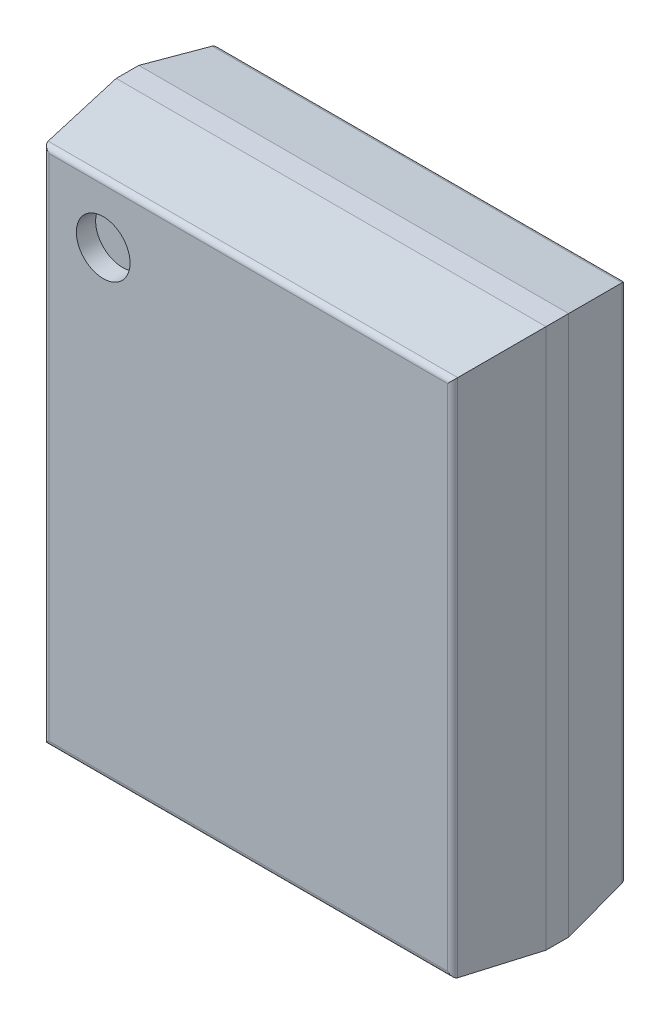
ISO-10303-21;
HEADER;
FILE_DESCRIPTION(('STEP AP214'),'2;1');
FILE_NAME('part.step','',(''),(''),'','','');
FILE_SCHEMA(('AUTOMOTIVE_DESIGN { 1 0 10303 214 1 1 1 1 }'));
ENDSEC;
DATA;
#1=APPLICATION_CONTEXT('core data for automotive mechanical design processes');
#2=APPLICATION_PROTOCOL_DEFINITION('international standard','automotive_design',2000,#1);
#3=PRODUCT_CONTEXT('',#1,'mechanical');
#4=PRODUCT('Part','Part','',(#3));
#5=PRODUCT_RELATED_PRODUCT_CATEGORY('part','',(#4));
#6=PRODUCT_DEFINITION_FORMATION('','',#4);
#7=PRODUCT_DEFINITION_CONTEXT('part definition',#1,'design');
#8=PRODUCT_DEFINITION('design','',#6,#7);
#9=PRODUCT_DEFINITION_SHAPE('','',#8);
#10=(LENGTH_UNIT() NAMED_UNIT(*) SI_UNIT(.MILLI.,.METRE.));
#11=(NAMED_UNIT(*) PLANE_ANGLE_UNIT() SI_UNIT($,.RADIAN.));
#12=(NAMED_UNIT(*) SI_UNIT($,.STERADIAN.) SOLID_ANGLE_UNIT());
#13=UNCERTAINTY_MEASURE_WITH_UNIT(LENGTH_MEASURE(1.E-05),#10,'distance_accuracy_value','');
#14=(GEOMETRIC_REPRESENTATION_CONTEXT(3) GLOBAL_UNCERTAINTY_ASSIGNED_CONTEXT((#13)) GLOBAL_UNIT_ASSIGNED_CONTEXT((#10,
#11,#12)) REPRESENTATION_CONTEXT('',''));
#15=CARTESIAN_POINT('',(0.,0.,0.));
#16=DIRECTION('',(0.,0.,1.));
#17=DIRECTION('',(1.,0.,0.));
#18=AXIS2_PLACEMENT_3D('',#15,#16,#17);
#19=CARTESIAN_POINT('',(-1.315,1.815,1.575));
#20=DIRECTION('',(0.,0.,1.));
#21=DIRECTION('',(1.,0.,0.));
#22=AXIS2_PLACEMENT_3D('',#19,#20,#21);
#23=PLANE('',#22);
#24=CARTESIAN_POINT('',(-1.315,1.815,1.575));
#25=DIRECTION('',(0.,0.,1.));
#26=DIRECTION('',(1.,0.,0.));
#27=AXIS2_PLACEMENT_3D('',#24,#25,#26);
#28=CIRCLE('',#27,0.24375);
#29=CARTESIAN_POINT('',(-1.07125,1.815,1.575));
#30=VERTEX_POINT('',#29);
#31=EDGE_CURVE('E11',#30,#30,#28,.T.);
#32=ORIENTED_EDGE('',*,*,#31,.T.);
#33=EDGE_LOOP('',(#32));
#34=FACE_BOUND('',#33,.T.);
#35=ADVANCED_FACE('F17',(#34),#23,.T.);
#36=CARTESIAN_POINT('',(-1.315,1.815,1.575));
#37=DIRECTION('',(0.,0.,1.));
#38=DIRECTION('',(1.,0.,0.));
#39=AXIS2_PLACEMENT_3D('',#36,#37,#38);
#40=CYLINDRICAL_SURFACE('',#39,0.24375);
#41=DIRECTION('',(0.,0.,1.));
#42=VECTOR('',#41,1.);
#43=CARTESIAN_POINT('',(-1.07125,1.815,1.575));
#44=LINE('',#43,#42);
#45=CARTESIAN_POINT('',(-1.07125,1.815,1.75));
#46=VERTEX_POINT('',#45);
#47=EDGE_CURVE('E26',#30,#46,#44,.T.);
#48=ORIENTED_EDGE('',*,*,#47,.T.);
#49=CARTESIAN_POINT('',(-1.315,1.815,1.75));
#50=DIRECTION('',(0.,0.,1.));
#51=DIRECTION('',(1.,0.,0.));
#52=AXIS2_PLACEMENT_3D('',#49,#50,#51);
#53=CIRCLE('',#52,0.24375);
#54=EDGE_CURVE('E202',#46,#46,#53,.T.);
#55=ORIENTED_EDGE('',*,*,#54,.T.);
#56=ORIENTED_EDGE('',*,*,#47,.F.);
#57=ORIENTED_EDGE('',*,*,#31,.F.);
#58=EDGE_LOOP('',(#48,#55,#56,#57));
#59=FACE_BOUND('',#58,.T.);
#60=ADVANCED_FACE('F385',(#59),#40,.F.);
#61=CARTESIAN_POINT('',(1.808558552786,-2.3525,1.7));
#62=DIRECTION('',(0.,1.,0.));
#63=DIRECTION('',(0.,0.,1.));
#64=AXIS2_PLACEMENT_3D('',#61,#62,#63);
#65=CYLINDRICAL_SURFACE('',#64,0.05);
#66=CARTESIAN_POINT('',(1.808558552786,-2.308558552786,1.7));
#67=DIRECTION('',(-0.707106781186548,-0.707106781186548,0.));
#68=DIRECTION('',(0.707106781186548,-0.707106781186548,0.));
#69=AXIS2_PLACEMENT_3D('',#66,#67,#68);
#70=ELLIPSE('',#69,0.07071067811865,0.05);
#71=CARTESIAN_POINT('',(1.858144342698,-2.358144342698,1.706422572601));
#72=VERTEX_POINT('',#71);
#73=CARTESIAN_POINT('',(1.808558552786,-2.308558552786,1.75));
#74=VERTEX_POINT('',#73);
#75=EDGE_CURVE('E317',#72,#74,#70,.T.);
#76=ORIENTED_EDGE('',*,*,#75,.F.);
#77=DIRECTION('',(0.,1.,0.));
#78=VECTOR('',#77,1.);
#79=CARTESIAN_POINT('',(1.858144342698,-2.3525,1.706422572601));
#80=LINE('',#79,#78);
#81=CARTESIAN_POINT('',(1.858144342698,2.358144342698,1.706422572601));
#82=VERTEX_POINT('',#81);
#83=EDGE_CURVE('E325',#72,#82,#80,.T.);
#84=ORIENTED_EDGE('',*,*,#83,.T.);
#85=CARTESIAN_POINT('',(1.808558552786,2.308558552786,1.7));
#86=DIRECTION('',(-0.707106781186548,0.707106781186548,0.));
#87=DIRECTION('',(0.707106781186548,0.707106781186548,0.));
#88=AXIS2_PLACEMENT_3D('',#85,#86,#87);
#89=ELLIPSE('',#88,0.07071067811865,0.05);
#90=CARTESIAN_POINT('',(1.808558552786,2.308558552786,1.75));
#91=VERTEX_POINT('',#90);
#92=EDGE_CURVE('E199',#91,#82,#89,.T.);
#93=ORIENTED_EDGE('',*,*,#92,.F.);
#94=DIRECTION('',(0.,1.,0.));
#95=VECTOR('',#94,1.);
#96=CARTESIAN_POINT('',(1.808558552786,-2.3525,1.75));
#97=LINE('',#96,#95);
#98=EDGE_CURVE('E316',#74,#91,#97,.T.);
#99=ORIENTED_EDGE('',*,*,#98,.F.);
#100=EDGE_LOOP('',(#76,#84,#93,#99));
#101=FACE_BOUND('',#100,.T.);
#102=ADVANCED_FACE('F389',(#101),#65,.T.);
#103=CARTESIAN_POINT('',(-1.8525,2.308558552786,1.7));
#104=DIRECTION('',(1.,0.,0.));
#105=DIRECTION('',(0.,0.,1.));
#106=AXIS2_PLACEMENT_3D('',#103,#104,#105);
#107=CYLINDRICAL_SURFACE('',#106,0.05);
#108=DIRECTION('',(1.,0.,0.));
#109=VECTOR('',#108,1.);
#110=CARTESIAN_POINT('',(-1.8525,2.308558552786,1.75));
#111=LINE('',#110,#109);
#112=CARTESIAN_POINT('',(-1.808558552786,2.308558552786,1.75));
#113=VERTEX_POINT('',#112);
#114=EDGE_CURVE('E20',#113,#91,#111,.T.);
#115=ORIENTED_EDGE('',*,*,#114,.T.);
#116=ORIENTED_EDGE('',*,*,#92,.T.);
#117=DIRECTION('',(1.,0.,0.));
#118=VECTOR('',#117,1.);
#119=CARTESIAN_POINT('',(-1.8525,2.358144342698,1.706422572601));
#120=LINE('',#119,#118);
#121=CARTESIAN_POINT('',(-1.858144342698,2.358144342698,1.706422572601));
#122=VERTEX_POINT('',#121);
#123=EDGE_CURVE('E311',#122,#82,#120,.T.);
#124=ORIENTED_EDGE('',*,*,#123,.F.);
#125=CARTESIAN_POINT('',(-1.808558552786,2.308558552786,1.7));
#126=DIRECTION('',(0.707106781186548,0.707106781186548,0.));
#127=DIRECTION('',(-0.707106781186548,0.707106781186548,0.));
#128=AXIS2_PLACEMENT_3D('',#125,#126,#127);
#129=ELLIPSE('',#128,0.07071067811865,0.05);
#130=EDGE_CURVE('E307',#122,#113,#129,.T.);
#131=ORIENTED_EDGE('',*,*,#130,.T.);
#132=EDGE_LOOP('',(#115,#116,#124,#131));
#133=FACE_BOUND('',#132,.T.);
#134=ADVANCED_FACE('F341',(#133),#107,.T.);
#135=CARTESIAN_POINT('',(-1.95,-2.45,1.75));
#136=DIRECTION('',(0.,0.,1.));
#137=DIRECTION('',(1.,0.,0.));
#138=AXIS2_PLACEMENT_3D('',#135,#136,#137);
#139=PLANE('',#138);
#140=ORIENTED_EDGE('',*,*,#54,.F.);
#141=EDGE_LOOP('',(#140));
#142=FACE_BOUND('',#141,.T.);
#143=DIRECTION('',(0.,1.,0.));
#144=VECTOR('',#143,1.);
#145=CARTESIAN_POINT('',(-1.808558552786,-2.3525,1.75));
#146=LINE('',#145,#144);
#147=CARTESIAN_POINT('',(-1.808558552786,-2.308558552786,1.75));
#148=VERTEX_POINT('',#147);
#149=EDGE_CURVE('E292',#148,#113,#146,.T.);
#150=ORIENTED_EDGE('',*,*,#149,.F.);
#151=DIRECTION('',(1.,0.,0.));
#152=VECTOR('',#151,1.);
#153=CARTESIAN_POINT('',(-1.8525,-2.308558552786,1.75));
#154=LINE('',#153,#152);
#155=EDGE_CURVE('E312',#148,#74,#154,.T.);
#156=ORIENTED_EDGE('',*,*,#155,.T.);
#157=ORIENTED_EDGE('',*,*,#98,.T.);
#158=ORIENTED_EDGE('',*,*,#114,.F.);
#159=EDGE_LOOP('',(#150,#156,#157,#158));
#160=FACE_BOUND('',#159,.T.);
#161=ADVANCED_FACE('F344',(#142,#160),#139,.T.);
#162=CARTESIAN_POINT('',(-1.8525,-2.308558552786,1.7));
#163=DIRECTION('',(1.,0.,0.));
#164=DIRECTION('',(0.,-0.991715798237691,0.12845145201896));
#165=AXIS2_PLACEMENT_3D('',#162,#163,#164);
#166=CYLINDRICAL_SURFACE('',#165,0.05);
#167=DIRECTION('',(1.,0.,0.));
#168=VECTOR('',#167,1.);
#169=CARTESIAN_POINT('',(-1.8525,-2.358144342698,1.706422572601));
#170=LINE('',#169,#168);
#171=CARTESIAN_POINT('',(-1.858144342698,-2.358144342698,1.706422572601));
#172=VERTEX_POINT('',#171);
#173=EDGE_CURVE('E293',#172,#72,#170,.T.);
#174=ORIENTED_EDGE('',*,*,#173,.T.);
#175=ORIENTED_EDGE('',*,*,#75,.T.);
#176=ORIENTED_EDGE('',*,*,#155,.F.);
#177=CARTESIAN_POINT('',(-1.808558552786,-2.308558552786,1.7));
#178=DIRECTION('',(-0.707106781186548,0.707106781186548,0.));
#179=DIRECTION('',(0.707106781186548,0.707106781186548,0.));
#180=AXIS2_PLACEMENT_3D('',#177,#178,#179);
#181=ELLIPSE('',#180,0.07071067811865,0.05);
#182=EDGE_CURVE('E288',#172,#148,#181,.T.);
#183=ORIENTED_EDGE('',*,*,#182,.F.);
#184=EDGE_LOOP('',(#174,#175,#176,#183));
#185=FACE_BOUND('',#184,.T.);
#186=ADVANCED_FACE('F350',(#185),#166,.T.);
#187=CARTESIAN_POINT('',(1.90125,-2.45,1.373623210137));
#188=DIRECTION('',(0.991715798237691,0.,0.12845145201896));
#189=DIRECTION('',(0.,-1.,0.));
#190=AXIS2_PLACEMENT_3D('',#187,#188,#189);
#191=PLANE('',#190);
#192=DIRECTION('',(-0.12740467794397,0.12740467794397,0.983634127140771));
#193=VECTOR('',#192,1.);
#194=CARTESIAN_POINT('',(1.870389001332,-2.370389001332,1.611887079072));
#195=LINE('',#194,#193);
#196=CARTESIAN_POINT('',(1.95,-2.45,0.997246420274));
#197=VERTEX_POINT('',#196);
#198=EDGE_CURVE('E297',#197,#72,#195,.T.);
#199=ORIENTED_EDGE('',*,*,#198,.F.);
#200=DIRECTION('',(0.,1.,0.));
#201=VECTOR('',#200,1.);
#202=CARTESIAN_POINT('',(1.95,-2.45,0.997246420274));
#203=LINE('',#202,#201);
#204=CARTESIAN_POINT('',(1.95,2.45,0.997246420274));
#205=VERTEX_POINT('',#204);
#206=EDGE_CURVE('E287',#197,#205,#203,.T.);
#207=ORIENTED_EDGE('',*,*,#206,.T.);
#208=DIRECTION('',(-0.12740467794397,-0.12740467794397,0.983634127140771));
#209=VECTOR('',#208,1.);
#210=CARTESIAN_POINT('',(1.830620719025,2.330620719025,1.91892007257));
#211=LINE('',#210,#209);
#212=EDGE_CURVE('E321',#205,#82,#211,.T.);
#213=ORIENTED_EDGE('',*,*,#212,.T.);
#214=ORIENTED_EDGE('',*,*,#83,.F.);
#215=EDGE_LOOP('',(#199,#207,#213,#214));
#216=FACE_BOUND('',#215,.T.);
#217=ADVANCED_FACE('F369',(#216),#191,.T.);
#218=CARTESIAN_POINT('',(-1.95,2.40125,1.373623210137));
#219=DIRECTION('',(0.,0.991715798237691,0.12845145201896));
#220=DIRECTION('',(1.,0.,0.));
#221=AXIS2_PLACEMENT_3D('',#218,#219,#220);
#222=PLANE('',#221);
#223=ORIENTED_EDGE('',*,*,#123,.T.);
#224=ORIENTED_EDGE('',*,*,#212,.F.);
#225=DIRECTION('',(1.,0.,0.));
#226=VECTOR('',#225,1.);
#227=CARTESIAN_POINT('',(-1.95,2.45,0.997246420274));
#228=LINE('',#227,#226);
#229=CARTESIAN_POINT('',(-1.95,2.45,0.997246420274));
#230=VERTEX_POINT('',#229);
#231=EDGE_CURVE('E283',#230,#205,#228,.T.);
#232=ORIENTED_EDGE('',*,*,#231,.F.);
#233=DIRECTION('',(0.12740467794397,-0.12740467794397,0.983634127140771));
#234=VECTOR('',#233,1.);
#235=CARTESIAN_POINT('',(-1.862273025351,2.362273025351,1.674546873663));
#236=LINE('',#235,#234);
#237=EDGE_CURVE('E271',#230,#122,#236,.T.);
#238=ORIENTED_EDGE('',*,*,#237,.T.);
#239=EDGE_LOOP('',(#223,#224,#232,#238));
#240=FACE_BOUND('',#239,.T.);
#241=ADVANCED_FACE('F374',(#240),#222,.T.);
#242=CARTESIAN_POINT('',(-1.808558552786,-2.3525,1.7));
#243=DIRECTION('',(0.,1.,0.));
#244=DIRECTION('',(-0.991715798237691,0.,0.12845145201896));
#245=AXIS2_PLACEMENT_3D('',#242,#243,#244);
#246=CYLINDRICAL_SURFACE('',#245,0.05);
#247=ORIENTED_EDGE('',*,*,#182,.T.);
#248=ORIENTED_EDGE('',*,*,#149,.T.);
#249=ORIENTED_EDGE('',*,*,#130,.F.);
#250=DIRECTION('',(0.,1.,0.));
#251=VECTOR('',#250,1.);
#252=CARTESIAN_POINT('',(-1.858144342698,-2.3525,1.706422572601));
#253=LINE('',#252,#251);
#254=EDGE_CURVE('E266',#172,#122,#253,.T.);
#255=ORIENTED_EDGE('',*,*,#254,.F.);
#256=EDGE_LOOP('',(#247,#248,#249,#255));
#257=FACE_BOUND('',#256,.T.);
#258=ADVANCED_FACE('F347',(#257),#246,.T.);
#259=CARTESIAN_POINT('',(-1.95,-2.40125,1.373623210137));
#260=DIRECTION('',(0.,0.991715798237691,-0.12845145201896));
#261=DIRECTION('',(-1.,0.,0.));
#262=AXIS2_PLACEMENT_3D('',#259,#260,#261);
#263=PLANE('',#262);
#264=DIRECTION('',(0.12740467794397,0.12740467794397,0.983634127140771));
#265=VECTOR('',#264,1.);
#266=CARTESIAN_POINT('',(-1.902041307658,-2.402041307658,1.367513880164));
#267=LINE('',#266,#265);
#268=CARTESIAN_POINT('',(-1.95,-2.45,0.997246420274));
#269=VERTEX_POINT('',#268);
#270=EDGE_CURVE('E275',#269,#172,#267,.T.);
#271=ORIENTED_EDGE('',*,*,#270,.F.);
#272=DIRECTION('',(1.,0.,0.));
#273=VECTOR('',#272,1.);
#274=CARTESIAN_POINT('',(-1.95,-2.45,0.997246420274));
#275=LINE('',#274,#273);
#276=EDGE_CURVE('E246',#269,#197,#275,.T.);
#277=ORIENTED_EDGE('',*,*,#276,.T.);
#278=ORIENTED_EDGE('',*,*,#198,.T.);
#279=ORIENTED_EDGE('',*,*,#173,.F.);
#280=EDGE_LOOP('',(#271,#277,#278,#279));
#281=FACE_BOUND('',#280,.T.);
#282=ADVANCED_FACE('F352',(#281),#263,.F.);
#283=CARTESIAN_POINT('',(1.95,-2.45,0.175));
#284=DIRECTION('',(1.,0.,0.));
#285=DIRECTION('',(0.,1.,0.));
#286=AXIS2_PLACEMENT_3D('',#283,#284,#285);
#287=PLANE('',#286);
#288=DIRECTION('',(0.,0.,1.));
#289=VECTOR('',#288,1.);
#290=CARTESIAN_POINT('',(1.95,-2.45,0.175));
#291=LINE('',#290,#289);
#292=CARTESIAN_POINT('',(1.95,-2.45,0.792246420274));
#293=VERTEX_POINT('',#292);
#294=EDGE_CURVE('E250',#293,#197,#291,.T.);
#295=ORIENTED_EDGE('',*,*,#294,.F.);
#296=DIRECTION('',(0.,1.,0.));
#297=VECTOR('',#296,1.);
#298=CARTESIAN_POINT('',(1.95,-2.45,0.792246420274));
#299=LINE('',#298,#297);
#300=CARTESIAN_POINT('',(1.95,2.45,0.792246420274));
#301=VERTEX_POINT('',#300);
#302=EDGE_CURVE('E225',#293,#301,#299,.T.);
#303=ORIENTED_EDGE('',*,*,#302,.T.);
#304=DIRECTION('',(0.,0.,1.));
#305=VECTOR('',#304,1.);
#306=CARTESIAN_POINT('',(1.95,2.45,0.175));
#307=LINE('',#306,#305);
#308=EDGE_CURVE('E279',#301,#205,#307,.T.);
#309=ORIENTED_EDGE('',*,*,#308,.T.);
#310=ORIENTED_EDGE('',*,*,#206,.F.);
#311=EDGE_LOOP('',(#295,#303,#309,#310));
#312=FACE_BOUND('',#311,.T.);
#313=ADVANCED_FACE('F366',(#312),#287,.T.);
#314=CARTESIAN_POINT('',(1.809778042507,-2.3525,0.225));
#315=DIRECTION('',(0.,1.,0.));
#316=DIRECTION('',(0.,0.,-1.));
#317=AXIS2_PLACEMENT_3D('',#314,#315,#316);
#318=CYLINDRICAL_SURFACE('',#317,0.05);
#319=DIRECTION('',(0.,1.,0.));
#320=VECTOR('',#319,1.);
#321=CARTESIAN_POINT('',(1.809778042507,-2.3525,0.175));
#322=LINE('',#321,#320);
#323=CARTESIAN_POINT('',(1.809778042507,-2.309778042507,0.175));
#324=VERTEX_POINT('',#323);
#325=CARTESIAN_POINT('',(1.809778042507,2.309778042507,0.175));
#326=VERTEX_POINT('',#325);
#327=EDGE_CURVE('E224',#324,#326,#322,.T.);
#328=ORIENTED_EDGE('',*,*,#327,.T.);
#329=CARTESIAN_POINT('',(1.809778042507,2.309778042507,0.225));
#330=DIRECTION('',(0.707106781186548,-0.707106781186548,0.));
#331=DIRECTION('',(0.707106781186548,0.707106781186548,0.));
#332=AXIS2_PLACEMENT_3D('',#329,#330,#331);
#333=ELLIPSE('',#332,0.07071067811865,0.05);
#334=CARTESIAN_POINT('',(1.859165697143,2.359165697143,0.217198745641));
#335=VERTEX_POINT('',#334);
#336=EDGE_CURVE('E264',#326,#335,#333,.T.);
#337=ORIENTED_EDGE('',*,*,#336,.T.);
#338=DIRECTION('',(0.,1.,0.));
#339=VECTOR('',#338,1.);
#340=CARTESIAN_POINT('',(1.859165697143,-2.3525,0.217198745641));
#341=LINE('',#340,#339);
#342=CARTESIAN_POINT('',(1.859165697143,-2.359165697143,0.217198745641));
#343=VERTEX_POINT('',#342);
#344=EDGE_CURVE('E254',#343,#335,#341,.T.);
#345=ORIENTED_EDGE('',*,*,#344,.F.);
#346=CARTESIAN_POINT('',(1.809778042507,-2.309778042507,0.225));
#347=DIRECTION('',(0.707106781186548,0.707106781186548,0.));
#348=DIRECTION('',(0.707106781186548,-0.707106781186548,0.));
#349=AXIS2_PLACEMENT_3D('',#346,#347,#348);
#350=ELLIPSE('',#349,0.07071067811865,0.05);
#351=EDGE_CURVE('E162',#343,#324,#350,.T.);
#352=ORIENTED_EDGE('',*,*,#351,.T.);
#353=EDGE_LOOP('',(#328,#337,#345,#352));
#354=FACE_BOUND('',#353,.T.);
#355=ADVANCED_FACE('F448',(#354),#318,.T.);
#356=CARTESIAN_POINT('',(-1.95,2.45,0.175));
#357=DIRECTION('',(0.,1.,0.));
#358=DIRECTION('',(1.,0.,0.));
#359=AXIS2_PLACEMENT_3D('',#356,#357,#358);
#360=PLANE('',#359);
#361=ORIENTED_EDGE('',*,*,#308,.F.);
#362=DIRECTION('',(1.,0.,0.));
#363=VECTOR('',#362,1.);
#364=CARTESIAN_POINT('',(-1.95,2.45,0.792246420274));
#365=LINE('',#364,#363);
#366=CARTESIAN_POINT('',(-1.95,2.45,0.792246420274));
#367=VERTEX_POINT('',#366);
#368=EDGE_CURVE('E198',#367,#301,#365,.T.);
#369=ORIENTED_EDGE('',*,*,#368,.F.);
#370=DIRECTION('',(0.,0.,1.));
#371=VECTOR('',#370,1.);
#372=CARTESIAN_POINT('',(-1.95,2.45,0.175));
#373=LINE('',#372,#371);
#374=EDGE_CURVE('E210',#367,#230,#373,.T.);
#375=ORIENTED_EDGE('',*,*,#374,.T.);
#376=ORIENTED_EDGE('',*,*,#231,.T.);
#377=EDGE_LOOP('',(#361,#369,#375,#376));
#378=FACE_BOUND('',#377,.T.);
#379=ADVANCED_FACE('F372',(#378),#360,.T.);
#380=CARTESIAN_POINT('',(-1.90125,-2.45,1.373623210137));
#381=DIRECTION('',(0.991715798237691,0.,-0.12845145201896));
#382=DIRECTION('',(0.,-1.,0.));
#383=AXIS2_PLACEMENT_3D('',#380,#381,#382);
#384=PLANE('',#383);
#385=ORIENTED_EDGE('',*,*,#254,.T.);
#386=ORIENTED_EDGE('',*,*,#237,.F.);
#387=DIRECTION('',(0.,1.,0.));
#388=VECTOR('',#387,1.);
#389=CARTESIAN_POINT('',(-1.95,-2.45,0.997246420274));
#390=LINE('',#389,#388);
#391=EDGE_CURVE('E155',#269,#230,#390,.T.);
#392=ORIENTED_EDGE('',*,*,#391,.F.);
#393=ORIENTED_EDGE('',*,*,#270,.T.);
#394=EDGE_LOOP('',(#385,#386,#392,#393));
#395=FACE_BOUND('',#394,.T.);
#396=ADVANCED_FACE('F356',(#395),#384,.F.);
#397=CARTESIAN_POINT('',(-1.8525,2.309778042507,0.225));
#398=DIRECTION('',(1.,0.,0.));
#399=DIRECTION('',(0.,0.,-1.));
#400=AXIS2_PLACEMENT_3D('',#397,#398,#399);
#401=CYLINDRICAL_SURFACE('',#400,0.05);
#402=CARTESIAN_POINT('',(-1.809778042507,2.309778042507,0.225));
#403=DIRECTION('',(-0.707106781186548,-0.707106781186548,0.));
#404=DIRECTION('',(-0.707106781186548,0.707106781186548,0.));
#405=AXIS2_PLACEMENT_3D('',#402,#403,#404);
#406=ELLIPSE('',#405,0.07071067811865,0.05);
#407=CARTESIAN_POINT('',(-1.859165697143,2.359165697143,0.217198745641));
#408=VERTEX_POINT('',#407);
#409=CARTESIAN_POINT('',(-1.809778042507,2.309778042507,0.175));
#410=VERTEX_POINT('',#409);
#411=EDGE_CURVE('E205',#408,#410,#406,.T.);
#412=ORIENTED_EDGE('',*,*,#411,.F.);
#413=DIRECTION('',(1.,0.,0.));
#414=VECTOR('',#413,1.);
#415=CARTESIAN_POINT('',(-1.8525,2.359165697143,0.217198745641));
#416=LINE('',#415,#414);
#417=EDGE_CURVE('E197',#408,#335,#416,.T.);
#418=ORIENTED_EDGE('',*,*,#417,.T.);
#419=ORIENTED_EDGE('',*,*,#336,.F.);
#420=DIRECTION('',(1.,0.,0.));
#421=VECTOR('',#420,1.);
#422=CARTESIAN_POINT('',(-1.8525,2.309778042507,0.175));
#423=LINE('',#422,#421);
#424=EDGE_CURVE('E221',#410,#326,#423,.T.);
#425=ORIENTED_EDGE('',*,*,#424,.F.);
#426=EDGE_LOOP('',(#412,#418,#419,#425));
#427=FACE_BOUND('',#426,.T.);
#428=ADVANCED_FACE('F477',(#427),#401,.T.);
#429=CARTESIAN_POINT('',(-1.95,-2.45,0.175));
#430=DIRECTION('',(0.,0.,1.));
#431=DIRECTION('',(1.,0.,0.));
#432=AXIS2_PLACEMENT_3D('',#429,#430,#431);
#433=PLANE('',#432);
#434=ORIENTED_EDGE('',*,*,#424,.T.);
#435=ORIENTED_EDGE('',*,*,#327,.F.);
#436=DIRECTION('',(1.,0.,0.));
#437=VECTOR('',#436,1.);
#438=CARTESIAN_POINT('',(-1.8525,-2.309778042507,0.175));
#439=LINE('',#438,#437);
#440=CARTESIAN_POINT('',(-1.809778042507,-2.309778042507,0.175));
#441=VERTEX_POINT('',#440);
#442=EDGE_CURVE('E232',#441,#324,#439,.T.);
#443=ORIENTED_EDGE('',*,*,#442,.F.);
#444=DIRECTION('',(0.,1.,0.));
#445=VECTOR('',#444,1.);
#446=CARTESIAN_POINT('',(-1.809778042507,-2.3525,0.175));
#447=LINE('',#446,#445);
#448=EDGE_CURVE('E151',#441,#410,#447,.T.);
#449=ORIENTED_EDGE('',*,*,#448,.T.);
#450=EDGE_LOOP('',(#434,#435,#443,#449));
#451=FACE_BOUND('',#450,.T.);
#452=ADVANCED_FACE('F487',(#451),#433,.F.);
#453=CARTESIAN_POINT('',(1.90125,-2.45,0.483623210137));
#454=DIRECTION('',(-0.987753092714965,0.,0.156025087187994));
#455=DIRECTION('',(0.,1.,0.));
#456=AXIS2_PLACEMENT_3D('',#453,#454,#455);
#457=PLANE('',#456);
#458=ORIENTED_EDGE('',*,*,#344,.T.);
#459=DIRECTION('',(-0.154159948465985,-0.154159948465985,-0.975945398358909));
#460=VECTOR('',#459,1.);
#461=CARTESIAN_POINT('',(1.797841283145,2.297841283145,-0.171029716054));
#462=LINE('',#461,#460);
#463=EDGE_CURVE('E193',#301,#335,#462,.T.);
#464=ORIENTED_EDGE('',*,*,#463,.F.);
#465=ORIENTED_EDGE('',*,*,#302,.F.);
#466=DIRECTION('',(-0.154159948465985,0.154159948465985,-0.975945398358909));
#467=VECTOR('',#466,1.);
#468=CARTESIAN_POINT('',(1.856066242937,-2.356066242937,0.197576930121));
#469=LINE('',#468,#467);
#470=EDGE_CURVE('E168',#293,#343,#469,.T.);
#471=ORIENTED_EDGE('',*,*,#470,.T.);
#472=EDGE_LOOP('',(#458,#464,#465,#471));
#473=FACE_BOUND('',#472,.T.);
#474=ADVANCED_FACE('F498',(#473),#457,.F.);
#475=CARTESIAN_POINT('',(-1.95,-2.45,0.175));
#476=DIRECTION('',(0.,1.,0.));
#477=DIRECTION('',(1.,0.,0.));
#478=AXIS2_PLACEMENT_3D('',#475,#476,#477);
#479=PLANE('',#478);
#480=ORIENTED_EDGE('',*,*,#276,.F.);
#481=DIRECTION('',(0.,0.,1.));
#482=VECTOR('',#481,1.);
#483=CARTESIAN_POINT('',(-1.95,-2.45,0.175));
#484=LINE('',#483,#482);
#485=CARTESIAN_POINT('',(-1.95,-2.45,0.792246420274));
#486=VERTEX_POINT('',#485);
#487=EDGE_CURVE('E213',#486,#269,#484,.T.);
#488=ORIENTED_EDGE('',*,*,#487,.F.);
#489=DIRECTION('',(1.,0.,0.));
#490=VECTOR('',#489,1.);
#491=CARTESIAN_POINT('',(-1.95,-2.45,0.792246420274));
#492=LINE('',#491,#490);
#493=EDGE_CURVE('E182',#486,#293,#492,.T.);
#494=ORIENTED_EDGE('',*,*,#493,.T.);
#495=ORIENTED_EDGE('',*,*,#294,.T.);
#496=EDGE_LOOP('',(#480,#488,#494,#495));
#497=FACE_BOUND('',#496,.T.);
#498=ADVANCED_FACE('F362',(#497),#479,.F.);
#499=CARTESIAN_POINT('',(-1.8525,-2.309778042507,0.225));
#500=DIRECTION('',(1.,0.,0.));
#501=DIRECTION('',(0.,-0.987753092714965,-0.156025087187994));
#502=AXIS2_PLACEMENT_3D('',#499,#500,#501);
#503=CYLINDRICAL_SURFACE('',#502,0.05);
#504=CARTESIAN_POINT('',(-1.809778042507,-2.309778042507,0.225));
#505=DIRECTION('',(0.707106781186548,-0.707106781186548,0.));
#506=DIRECTION('',(0.707106781186548,0.707106781186548,0.));
#507=AXIS2_PLACEMENT_3D('',#504,#505,#506);
#508=ELLIPSE('',#507,0.07071067811865,0.05);
#509=CARTESIAN_POINT('',(-1.859165697143,-2.359165697143,0.217198745641));
#510=VERTEX_POINT('',#509);
#511=EDGE_CURVE('E143',#510,#441,#508,.T.);
#512=ORIENTED_EDGE('',*,*,#511,.T.);
#513=ORIENTED_EDGE('',*,*,#442,.T.);
#514=ORIENTED_EDGE('',*,*,#351,.F.);
#515=DIRECTION('',(1.,0.,0.));
#516=VECTOR('',#515,1.);
#517=CARTESIAN_POINT('',(-1.8525,-2.359165697143,0.217198745641));
#518=LINE('',#517,#516);
#519=EDGE_CURVE('E159',#510,#343,#518,.T.);
#520=ORIENTED_EDGE('',*,*,#519,.F.);
#521=EDGE_LOOP('',(#512,#513,#514,#520));
#522=FACE_BOUND('',#521,.T.);
#523=ADVANCED_FACE('F160',(#522),#503,.T.);
#524=CARTESIAN_POINT('',(-1.95,2.40125,0.483623210137));
#525=DIRECTION('',(0.,-0.987753092714965,0.156025087187994));
#526=DIRECTION('',(-1.,0.,0.));
#527=AXIS2_PLACEMENT_3D('',#524,#525,#526);
#528=PLANE('',#527);
#529=DIRECTION('',(0.154159948465985,-0.154159948465985,-0.975945398358909));
#530=VECTOR('',#529,1.);
#531=CARTESIAN_POINT('',(-1.844183598082,2.344183598082,0.122351083963));
#532=LINE('',#531,#530);
#533=EDGE_CURVE('E176',#367,#408,#532,.T.);
#534=ORIENTED_EDGE('',*,*,#533,.F.);
#535=ORIENTED_EDGE('',*,*,#368,.T.);
#536=ORIENTED_EDGE('',*,*,#463,.T.);
#537=ORIENTED_EDGE('',*,*,#417,.F.);
#538=EDGE_LOOP('',(#534,#535,#536,#537));
#539=FACE_BOUND('',#538,.T.);
#540=ADVANCED_FACE('F528',(#539),#528,.F.);
#541=CARTESIAN_POINT('',(-1.95,-2.45,0.175));
#542=DIRECTION('',(1.,0.,0.));
#543=DIRECTION('',(0.,1.,0.));
#544=AXIS2_PLACEMENT_3D('',#541,#542,#543);
#545=PLANE('',#544);
#546=ORIENTED_EDGE('',*,*,#391,.T.);
#547=ORIENTED_EDGE('',*,*,#374,.F.);
#548=DIRECTION('',(0.,1.,0.));
#549=VECTOR('',#548,1.);
#550=CARTESIAN_POINT('',(-1.95,-2.45,0.792246420274));
#551=LINE('',#550,#549);
#552=EDGE_CURVE('E185',#486,#367,#551,.T.);
#553=ORIENTED_EDGE('',*,*,#552,.F.);
#554=ORIENTED_EDGE('',*,*,#487,.T.);
#555=EDGE_LOOP('',(#546,#547,#553,#554));
#556=FACE_BOUND('',#555,.T.);
#557=ADVANCED_FACE('F360',(#556),#545,.F.);
#558=CARTESIAN_POINT('',(-1.809778042507,-2.3525,0.225));
#559=DIRECTION('',(0.,1.,0.));
#560=DIRECTION('',(-0.987753092714965,0.,-0.156025087187994));
#561=AXIS2_PLACEMENT_3D('',#558,#559,#560);
#562=CYLINDRICAL_SURFACE('',#561,0.05);
#563=DIRECTION('',(0.,1.,0.));
#564=VECTOR('',#563,1.);
#565=CARTESIAN_POINT('',(-1.859165697143,-2.3525,0.217198745641));
#566=LINE('',#565,#564);
#567=EDGE_CURVE('E148',#510,#408,#566,.T.);
#568=ORIENTED_EDGE('',*,*,#567,.T.);
#569=ORIENTED_EDGE('',*,*,#411,.T.);
#570=ORIENTED_EDGE('',*,*,#448,.F.);
#571=ORIENTED_EDGE('',*,*,#511,.F.);
#572=EDGE_LOOP('',(#568,#569,#570,#571));
#573=FACE_BOUND('',#572,.T.);
#574=ADVANCED_FACE('F145',(#573),#562,.T.);
#575=CARTESIAN_POINT('',(-1.95,-2.40125,0.483623210137));
#576=DIRECTION('',(0.,-0.987753092714965,-0.156025087187994));
#577=DIRECTION('',(0.,0.156025087187994,-0.987753092714965));
#578=AXIS2_PLACEMENT_3D('',#575,#576,#577);
#579=PLANE('',#578);
#580=ORIENTED_EDGE('',*,*,#519,.T.);
#581=ORIENTED_EDGE('',*,*,#470,.F.);
#582=ORIENTED_EDGE('',*,*,#493,.F.);
#583=DIRECTION('',(0.154159948465985,0.154159948465985,-0.975945398358909));
#584=VECTOR('',#583,1.);
#585=CARTESIAN_POINT('',(-1.902408557873,-2.402408557873,0.490957730138));
#586=LINE('',#585,#584);
#587=EDGE_CURVE('E174',#486,#510,#586,.T.);
#588=ORIENTED_EDGE('',*,*,#587,.T.);
#589=EDGE_LOOP('',(#580,#581,#582,#588));
#590=FACE_BOUND('',#589,.T.);
#591=ADVANCED_FACE('F180',(#590),#579,.T.);
#592=CARTESIAN_POINT('',(-1.90125,-2.45,0.483623210137));
#593=DIRECTION('',(-0.987753092714965,0.,-0.156025087187994));
#594=DIRECTION('',(-0.156025087187994,0.,0.987753092714965));
#595=AXIS2_PLACEMENT_3D('',#592,#593,#594);
#596=PLANE('',#595);
#597=ORIENTED_EDGE('',*,*,#587,.F.);
#598=ORIENTED_EDGE('',*,*,#552,.T.);
#599=ORIENTED_EDGE('',*,*,#533,.T.);
#600=ORIENTED_EDGE('',*,*,#567,.F.);
#601=EDGE_LOOP('',(#597,#598,#599,#600));
#602=FACE_BOUND('',#601,.T.);
#603=ADVANCED_FACE('F172',(#602),#596,.T.);
#604=CLOSED_SHELL('',(#35,#60,#102,#134,#161,#186,#217,#241,#258,#282,#313,#355,#379,#396,#428,
#452,#474,#498,#523,#540,#557,#574,#591,#603));
#605=MANIFOLD_SOLID_BREP('B1',#604);
#606=ADVANCED_BREP_SHAPE_REPRESENTATION('',(#18,#605),#14);
#607=SHAPE_DEFINITION_REPRESENTATION(#9,#606);
ENDSEC;
END-ISO-10303-21;
